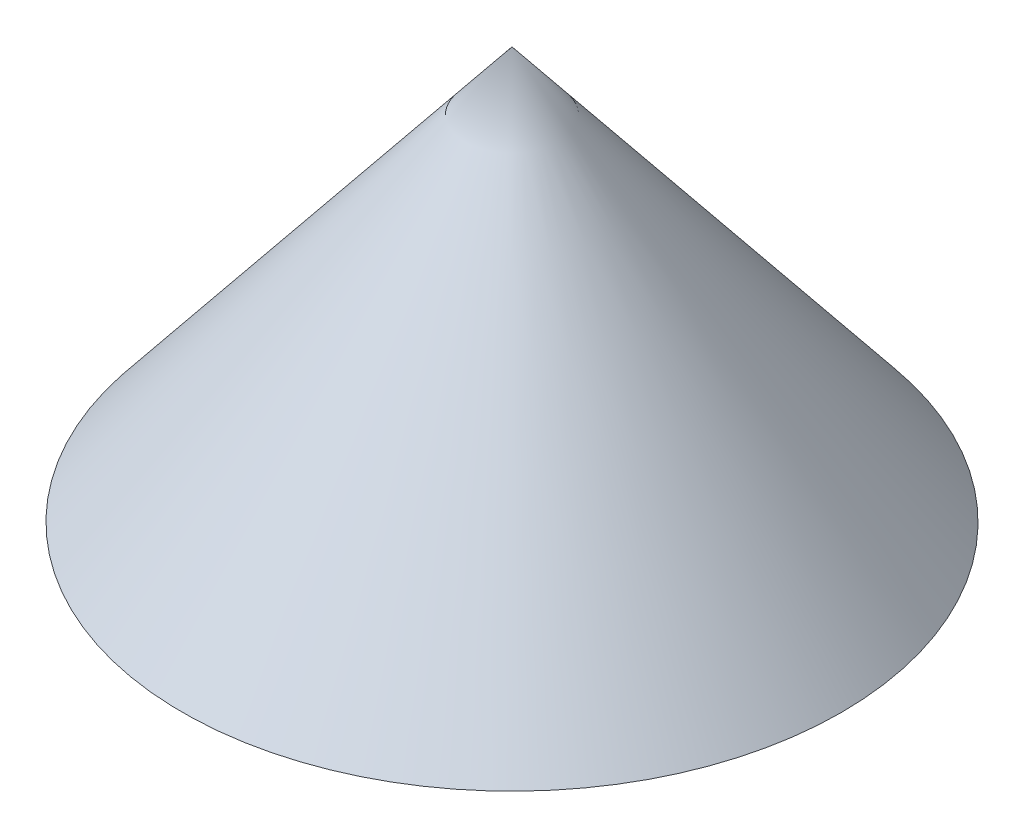
ISO-10303-21;
HEADER;
FILE_DESCRIPTION(('STEP AP214'),'2;1');
FILE_NAME('part.step','',(''),(''),'','','');
FILE_SCHEMA(('AUTOMOTIVE_DESIGN { 1 0 10303 214 1 1 1 1 }'));
ENDSEC;
DATA;
#1=APPLICATION_CONTEXT('core data for automotive mechanical design processes');
#2=APPLICATION_PROTOCOL_DEFINITION('international standard','automotive_design',2000,#1);
#3=PRODUCT_CONTEXT('',#1,'mechanical');
#4=PRODUCT('Part','Part','',(#3));
#5=PRODUCT_RELATED_PRODUCT_CATEGORY('part','',(#4));
#6=PRODUCT_DEFINITION_FORMATION('','',#4);
#7=PRODUCT_DEFINITION_CONTEXT('part definition',#1,'design');
#8=PRODUCT_DEFINITION('design','',#6,#7);
#9=PRODUCT_DEFINITION_SHAPE('','',#8);
#10=(LENGTH_UNIT() NAMED_UNIT(*) SI_UNIT(.MILLI.,.METRE.));
#11=(NAMED_UNIT(*) PLANE_ANGLE_UNIT() SI_UNIT($,.RADIAN.));
#12=(NAMED_UNIT(*) SI_UNIT($,.STERADIAN.) SOLID_ANGLE_UNIT());
#13=UNCERTAINTY_MEASURE_WITH_UNIT(LENGTH_MEASURE(1.E-05),#10,'distance_accuracy_value','');
#14=(GEOMETRIC_REPRESENTATION_CONTEXT(3) GLOBAL_UNCERTAINTY_ASSIGNED_CONTEXT((#13)) GLOBAL_UNIT_ASSIGNED_CONTEXT((#10,
#11,#12)) REPRESENTATION_CONTEXT('',''));
#15=CARTESIAN_POINT('',(0.,0.,0.));
#16=DIRECTION('',(0.,0.,1.));
#17=DIRECTION('',(1.,0.,0.));
#18=AXIS2_PLACEMENT_3D('',#15,#16,#17);
#19=CARTESIAN_POINT('',(0.,0.,0.));
#20=DIRECTION('',(0.,-1.,0.));
#21=DIRECTION('',(1.,0.,0.));
#22=AXIS2_PLACEMENT_3D('',#19,#20,#21);
#23=PLANE('',#22);
#24=CARTESIAN_POINT('',(0.,0.,0.));
#25=DIRECTION('',(0.,-1.,0.));
#26=DIRECTION('',(1.,0.,0.));
#27=AXIS2_PLACEMENT_3D('',#24,#25,#26);
#28=CIRCLE('',#27,25.);
#29=CARTESIAN_POINT('',(25.,0.,0.));
#30=VERTEX_POINT('',#29);
#31=EDGE_CURVE('E11',#30,#30,#28,.T.);
#32=ORIENTED_EDGE('',*,*,#31,.T.);
#33=EDGE_LOOP('',(#32));
#34=FACE_BOUND('',#33,.T.);
#35=ADVANCED_FACE('F33',(#34),#23,.T.);
#36=CARTESIAN_POINT('',(0.,0.,0.));
#37=DIRECTION('',(0.,-1.,0.));
#38=DIRECTION('',(1.,0.,0.));
#39=AXIS2_PLACEMENT_3D('',#36,#37,#38);
#40=CONICAL_SURFACE('',#39,25.,0.675131532937032);
#41=CARTESIAN_POINT('',(0.,31.224989991992,0.));
#42=VERTEX_POINT('',#41);
#43=VERTEX_LOOP('',#42);
#44=FACE_BOUND('',#43,.T.);
#45=ORIENTED_EDGE('',*,*,#31,.F.);
#46=EDGE_LOOP('',(#45));
#47=FACE_BOUND('',#46,.T.);
#48=ADVANCED_FACE('F40',(#44,#47),#40,.T.);
#49=CLOSED_SHELL('',(#35,#48));
#50=MANIFOLD_SOLID_BREP('B2',#49);
#51=ADVANCED_BREP_SHAPE_REPRESENTATION('',(#18,#50),#14);
#52=SHAPE_DEFINITION_REPRESENTATION(#9,#51);
ENDSEC;
END-ISO-10303-21;
